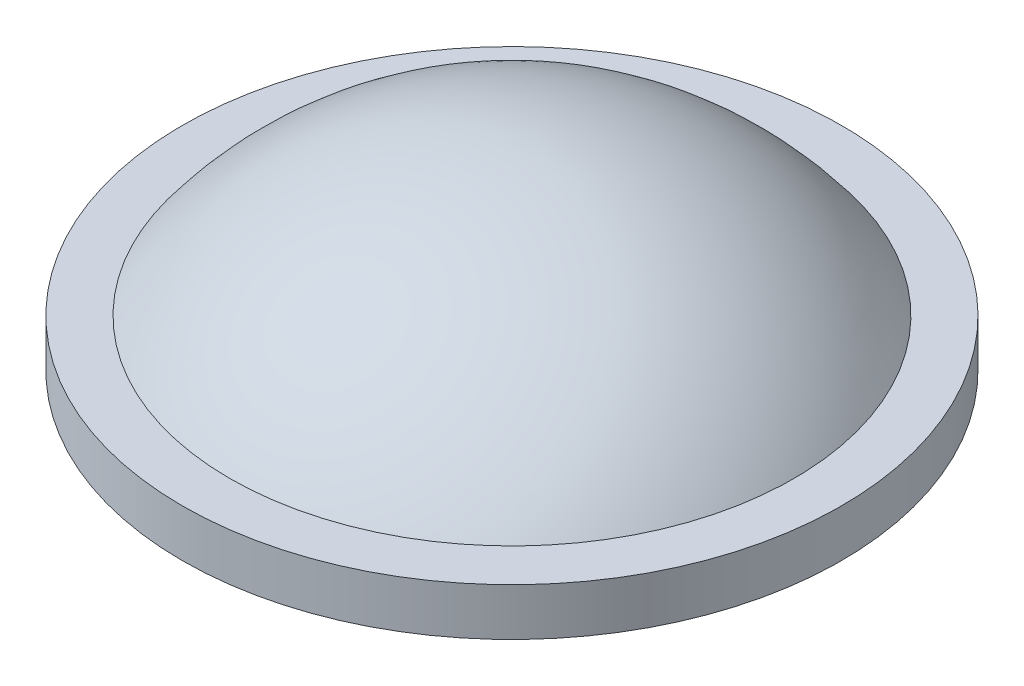
ISO-10303-21;
HEADER;
FILE_DESCRIPTION(('STEP AP214'),'2;1');
FILE_NAME('part.step','',(''),(''),'','','');
FILE_SCHEMA(('AUTOMOTIVE_DESIGN { 1 0 10303 214 1 1 1 1 }'));
ENDSEC;
DATA;
#1=APPLICATION_CONTEXT('core data for automotive mechanical design processes');
#2=APPLICATION_PROTOCOL_DEFINITION('international standard','automotive_design',2000,#1);
#3=PRODUCT_CONTEXT('',#1,'mechanical');
#4=PRODUCT('Part','Part','',(#3));
#5=PRODUCT_RELATED_PRODUCT_CATEGORY('part','',(#4));
#6=PRODUCT_DEFINITION_FORMATION('','',#4);
#7=PRODUCT_DEFINITION_CONTEXT('part definition',#1,'design');
#8=PRODUCT_DEFINITION('design','',#6,#7);
#9=PRODUCT_DEFINITION_SHAPE('','',#8);
#10=(LENGTH_UNIT() NAMED_UNIT(*) SI_UNIT(.MILLI.,.METRE.));
#11=(NAMED_UNIT(*) PLANE_ANGLE_UNIT() SI_UNIT($,.RADIAN.));
#12=(NAMED_UNIT(*) SI_UNIT($,.STERADIAN.) SOLID_ANGLE_UNIT());
#13=UNCERTAINTY_MEASURE_WITH_UNIT(LENGTH_MEASURE(1.E-05),#10,'distance_accuracy_value','');
#14=(GEOMETRIC_REPRESENTATION_CONTEXT(3) GLOBAL_UNCERTAINTY_ASSIGNED_CONTEXT((#13)) GLOBAL_UNIT_ASSIGNED_CONTEXT((#10,
#11,#12)) REPRESENTATION_CONTEXT('',''));
#15=CARTESIAN_POINT('',(0.,0.,0.));
#16=DIRECTION('',(0.,0.,1.));
#17=DIRECTION('',(1.,0.,0.));
#18=AXIS2_PLACEMENT_3D('',#15,#16,#17);
#19=CARTESIAN_POINT('',(0.,0.,0.));
#20=DIRECTION('',(0.,-1.,0.));
#21=DIRECTION('',(0.,0.,-1.));
#22=AXIS2_PLACEMENT_3D('',#19,#20,#21);
#23=PLANE('',#22);
#24=CARTESIAN_POINT('',(0.,0.,0.));
#25=DIRECTION('',(0.,1.,0.));
#26=DIRECTION('',(0.,0.,1.));
#27=AXIS2_PLACEMENT_3D('',#24,#25,#26);
#28=CIRCLE('',#27,6.25);
#29=CARTESIAN_POINT('',(0.,0.,6.25));
#30=VERTEX_POINT('',#29);
#31=EDGE_CURVE('E10',#30,#30,#28,.T.);
#32=ORIENTED_EDGE('',*,*,#31,.F.);
#33=EDGE_LOOP('',(#32));
#34=FACE_BOUND('',#33,.T.);
#35=ADVANCED_FACE('F31',(#34),#23,.T.);
#36=CARTESIAN_POINT('',(0.,3.6,0.));
#37=DIRECTION('',(0.,1.,0.));
#38=DIRECTION('',(0.,0.,1.));
#39=AXIS2_PLACEMENT_3D('',#36,#37,#38);
#40=CYLINDRICAL_SURFACE('',#39,6.25);
#41=ORIENTED_EDGE('',*,*,#31,.T.);
#42=EDGE_LOOP('',(#41));
#43=FACE_BOUND('',#42,.T.);
#44=CARTESIAN_POINT('',(0.,0.899999999999999,0.));
#45=DIRECTION('',(0.,1.,0.));
#46=DIRECTION('',(0.,0.,1.));
#47=AXIS2_PLACEMENT_3D('',#44,#45,#46);
#48=CIRCLE('',#47,6.25);
#49=CARTESIAN_POINT('',(0.,0.899999999999999,6.25));
#50=VERTEX_POINT('',#49);
#51=EDGE_CURVE('E37',#50,#50,#48,.T.);
#52=ORIENTED_EDGE('',*,*,#51,.F.);
#53=EDGE_LOOP('',(#52));
#54=FACE_BOUND('',#53,.T.);
#55=ADVANCED_FACE('F52',(#43,#54),#40,.T.);
#56=CARTESIAN_POINT('',(0.,0.899999999999999,6.25));
#57=DIRECTION('',(0.,1.,0.));
#58=DIRECTION('',(0.,0.,1.));
#59=AXIS2_PLACEMENT_3D('',#56,#57,#58);
#60=PLANE('',#59);
#61=ORIENTED_EDGE('',*,*,#51,.T.);
#62=EDGE_LOOP('',(#61));
#63=FACE_BOUND('',#62,.T.);
#64=CARTESIAN_POINT('',(0.,0.899999999999999,0.));
#65=DIRECTION('',(0.,1.,0.));
#66=DIRECTION('',(0.,0.,1.));
#67=AXIS2_PLACEMENT_3D('',#64,#65,#66);
#68=CIRCLE('',#67,5.35);
#69=CARTESIAN_POINT('',(0.,0.899999999999999,5.35));
#70=VERTEX_POINT('',#69);
#71=EDGE_CURVE('E41',#70,#70,#68,.T.);
#72=ORIENTED_EDGE('',*,*,#71,.F.);
#73=EDGE_LOOP('',(#72));
#74=FACE_BOUND('',#73,.T.);
#75=ADVANCED_FACE('F50',(#63,#74),#60,.T.);
#76=CARTESIAN_POINT('',(0.,-3.05046296296296,0.));
#77=DIRECTION('',(0.,1.,0.));
#78=DIRECTION('',(0.,0.,-1.));
#79=AXIS2_PLACEMENT_3D('',#76,#77,#78);
#80=SPHERICAL_SURFACE('',#79,6.65046296296296);
#81=ORIENTED_EDGE('',*,*,#71,.T.);
#82=EDGE_LOOP('',(#81));
#83=FACE_BOUND('',#82,.T.);
#84=ADVANCED_FACE('F48',(#83),#80,.T.);
#85=CLOSED_SHELL('',(#35,#55,#75,#84));
#86=MANIFOLD_SOLID_BREP('B2',#85);
#87=ADVANCED_BREP_SHAPE_REPRESENTATION('',(#18,#86),#14);
#88=SHAPE_DEFINITION_REPRESENTATION(#9,#87);
ENDSEC;
END-ISO-10303-21;
